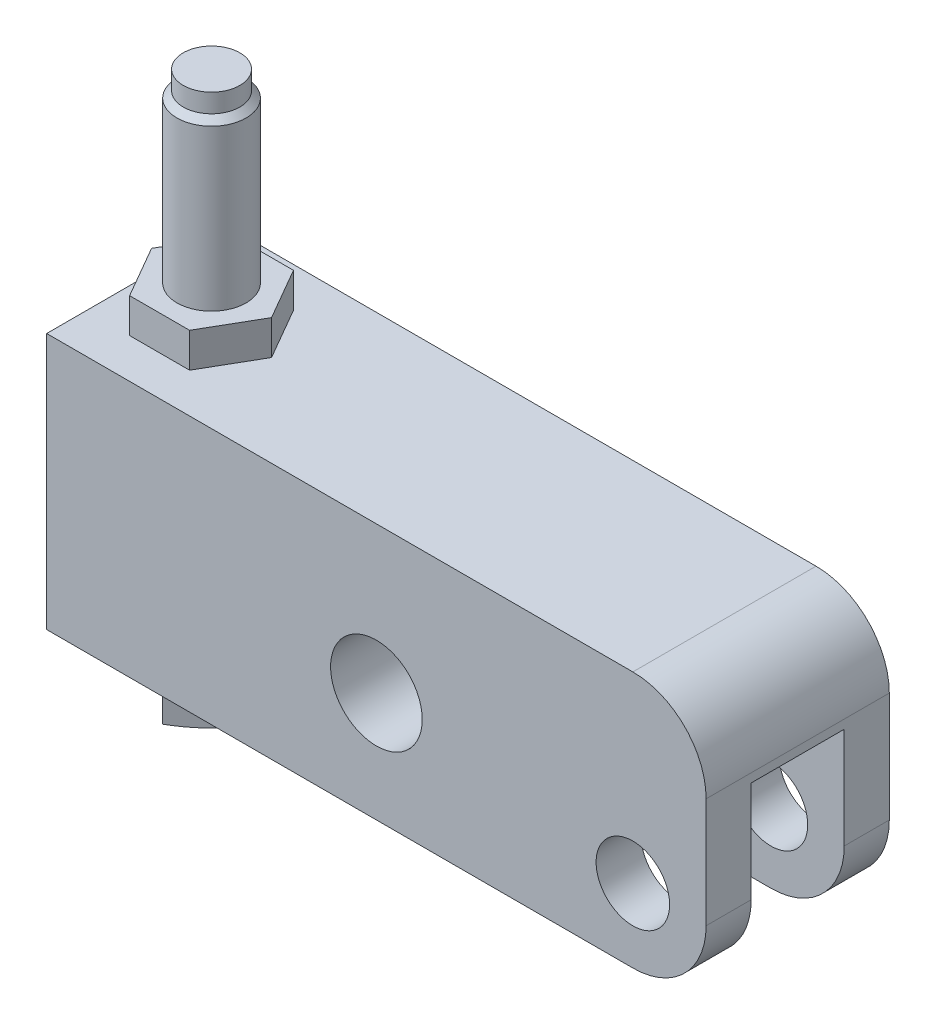
ISO-10303-21;
HEADER;
FILE_DESCRIPTION(('STEP AP214'),'2;1');
FILE_NAME('part.step','',(''),(''),'','','');
FILE_SCHEMA(('AUTOMOTIVE_DESIGN { 1 0 10303 214 1 1 1 1 }'));
ENDSEC;
DATA;
#1=APPLICATION_CONTEXT('core data for automotive mechanical design processes');
#2=APPLICATION_PROTOCOL_DEFINITION('international standard','automotive_design',2000,#1);
#3=PRODUCT_CONTEXT('',#1,'mechanical');
#4=PRODUCT('Part','Part','',(#3));
#5=PRODUCT_RELATED_PRODUCT_CATEGORY('part','',(#4));
#6=PRODUCT_DEFINITION_FORMATION('','',#4);
#7=PRODUCT_DEFINITION_CONTEXT('part definition',#1,'design');
#8=PRODUCT_DEFINITION('design','',#6,#7);
#9=PRODUCT_DEFINITION_SHAPE('','',#8);
#10=(LENGTH_UNIT() NAMED_UNIT(*) SI_UNIT(.MILLI.,.METRE.));
#11=(NAMED_UNIT(*) PLANE_ANGLE_UNIT() SI_UNIT($,.RADIAN.));
#12=(NAMED_UNIT(*) SI_UNIT($,.STERADIAN.) SOLID_ANGLE_UNIT());
#13=UNCERTAINTY_MEASURE_WITH_UNIT(LENGTH_MEASURE(1.E-05),#10,'distance_accuracy_value','');
#14=(GEOMETRIC_REPRESENTATION_CONTEXT(3) GLOBAL_UNCERTAINTY_ASSIGNED_CONTEXT((#13)) GLOBAL_UNIT_ASSIGNED_CONTEXT((#10,
#11,#12)) REPRESENTATION_CONTEXT('',''));
#15=CARTESIAN_POINT('',(0.,0.,0.));
#16=DIRECTION('',(0.,0.,1.));
#17=DIRECTION('',(1.,0.,0.));
#18=AXIS2_PLACEMENT_3D('',#15,#16,#17);
#19=CARTESIAN_POINT('',(-94.8944,-13.4112,0.));
#20=DIRECTION('',(0.,1.,0.));
#21=DIRECTION('',(0.,0.,1.));
#22=AXIS2_PLACEMENT_3D('',#19,#20,#21);
#23=PLANE('',#22);
#24=DIRECTION('',(0.707106781186547,0.,0.707106781186548));
#25=VECTOR('',#24,1.);
#26=CARTESIAN_POINT('',(-97.3773617782893,-13.4112,0.));
#27=LINE('',#26,#25);
#28=CARTESIAN_POINT('',(-93.1386808891447,-13.4112,4.23868088914464));
#29=VERTEX_POINT('',#28);
#30=CARTESIAN_POINT('',(-88.9,-13.4112,8.47736177828929));
#31=VERTEX_POINT('',#30);
#32=EDGE_CURVE('E191',#29,#31,#27,.T.);
#33=ORIENTED_EDGE('',*,*,#32,.T.);
#34=DIRECTION('',(0.707106781186547,0.,-0.707106781186548));
#35=VECTOR('',#34,1.);
#36=CARTESIAN_POINT('',(-88.9,-13.4112,8.47736177828929));
#37=LINE('',#36,#35);
#38=CARTESIAN_POINT('',(-84.6613191108553,-13.4112,4.23868088914464));
#39=VERTEX_POINT('',#38);
#40=EDGE_CURVE('E200',#31,#39,#37,.T.);
#41=ORIENTED_EDGE('',*,*,#40,.T.);
#42=CARTESIAN_POINT('',(-88.9,-13.4112,0.));
#43=DIRECTION('',(0.,1.,0.));
#44=DIRECTION('',(0.,0.,1.));
#45=AXIS2_PLACEMENT_3D('',#42,#43,#44);
#46=CIRCLE('',#45,5.99439999999997);
#47=EDGE_CURVE('E208',#29,#39,#46,.T.);
#48=ORIENTED_EDGE('',*,*,#47,.F.);
#49=EDGE_LOOP('',(#33,#41,#48));
#50=FACE_BOUND('',#49,.T.);
#51=ADVANCED_FACE('F33',(#50),#23,.T.);
#52=CARTESIAN_POINT('',(-84.6613191108553,-13.4112,-4.23868088914464));
#53=VERTEX_POINT('',#52);
#54=EDGE_CURVE('E226',#39,#53,#46,.T.);
#55=ORIENTED_EDGE('',*,*,#54,.F.);
#56=CARTESIAN_POINT('',(-80.4226382217107,-13.4112,0.));
#57=VERTEX_POINT('',#56);
#58=EDGE_CURVE('E203',#39,#57,#37,.T.);
#59=ORIENTED_EDGE('',*,*,#58,.T.);
#60=DIRECTION('',(-0.707106781186548,0.,-0.707106781186548));
#61=VECTOR('',#60,1.);
#62=CARTESIAN_POINT('',(-80.4226382217107,-13.4112,0.));
#63=LINE('',#62,#61);
#64=EDGE_CURVE('E400',#57,#53,#63,.T.);
#65=ORIENTED_EDGE('',*,*,#64,.T.);
#66=EDGE_LOOP('',(#55,#59,#65));
#67=FACE_BOUND('',#66,.T.);
#68=ADVANCED_FACE('F406',(#67),#23,.T.);
#69=CARTESIAN_POINT('',(-93.1386808891446,-13.4112,-4.23868088914464));
#70=VERTEX_POINT('',#69);
#71=EDGE_CURVE('E230',#53,#70,#46,.T.);
#72=ORIENTED_EDGE('',*,*,#71,.F.);
#73=CARTESIAN_POINT('',(-88.9,-13.4112,-8.47736177828928));
#74=VERTEX_POINT('',#73);
#75=EDGE_CURVE('E402',#53,#74,#63,.T.);
#76=ORIENTED_EDGE('',*,*,#75,.T.);
#77=DIRECTION('',(-0.707106781186548,0.,0.707106781186548));
#78=VECTOR('',#77,1.);
#79=CARTESIAN_POINT('',(-88.9,-13.4112,-8.47736177828928));
#80=LINE('',#79,#78);
#81=EDGE_CURVE('E210',#74,#70,#80,.T.);
#82=ORIENTED_EDGE('',*,*,#81,.T.);
#83=EDGE_LOOP('',(#72,#76,#82));
#84=FACE_BOUND('',#83,.T.);
#85=ADVANCED_FACE('F418',(#84),#23,.T.);
#86=CARTESIAN_POINT('',(-97.3773617782893,-13.4112,0.));
#87=VERTEX_POINT('',#86);
#88=EDGE_CURVE('E213',#70,#87,#80,.T.);
#89=ORIENTED_EDGE('',*,*,#88,.T.);
#90=EDGE_CURVE('E48',#87,#29,#27,.T.);
#91=ORIENTED_EDGE('',*,*,#90,.T.);
#92=EDGE_CURVE('E412',#70,#29,#46,.T.);
#93=ORIENTED_EDGE('',*,*,#92,.F.);
#94=EDGE_LOOP('',(#89,#91,#93));
#95=FACE_BOUND('',#94,.T.);
#96=ADVANCED_FACE('F415',(#95),#23,.T.);
#97=CARTESIAN_POINT('',(-101.6,31.75,15.875));
#98=DIRECTION('',(0.,-1.,0.));
#99=DIRECTION('',(0.,0.,-1.));
#100=AXIS2_PLACEMENT_3D('',#97,#98,#99);
#101=PLANE('',#100);
#102=DIRECTION('',(-1.,0.,0.));
#103=VECTOR('',#102,1.);
#104=CARTESIAN_POINT('',(-101.6,31.75,15.875));
#105=LINE('',#104,#103);
#106=CARTESIAN_POINT('',(0.,31.75,15.875));
#107=VERTEX_POINT('',#106);
#108=CARTESIAN_POINT('',(-101.6,31.75,15.875));
#109=VERTEX_POINT('',#108);
#110=EDGE_CURVE('E339',#107,#109,#105,.T.);
#111=ORIENTED_EDGE('',*,*,#110,.F.);
#112=DIRECTION('',(0.,0.,-1.));
#113=VECTOR('',#112,1.);
#114=CARTESIAN_POINT('',(0.,31.75,15.875));
#115=LINE('',#114,#113);
#116=CARTESIAN_POINT('',(0.,31.75,-15.875));
#117=VERTEX_POINT('',#116);
#118=EDGE_CURVE('E356',#107,#117,#115,.T.);
#119=ORIENTED_EDGE('',*,*,#118,.T.);
#120=DIRECTION('',(-1.,0.,0.));
#121=VECTOR('',#120,1.);
#122=CARTESIAN_POINT('',(-101.6,31.75,-15.875));
#123=LINE('',#122,#121);
#124=CARTESIAN_POINT('',(-101.6,31.75,-15.875));
#125=VERTEX_POINT('',#124);
#126=EDGE_CURVE('E333',#117,#125,#123,.T.);
#127=ORIENTED_EDGE('',*,*,#126,.T.);
#128=DIRECTION('',(0.,0.,-1.));
#129=VECTOR('',#128,1.);
#130=CARTESIAN_POINT('',(-101.6,31.75,15.875));
#131=LINE('',#130,#129);
#132=EDGE_CURVE('E341',#109,#125,#131,.T.);
#133=ORIENTED_EDGE('',*,*,#132,.F.);
#134=EDGE_LOOP('',(#111,#119,#127,#133));
#135=FACE_BOUND('',#134,.T.);
#136=DIRECTION('',(0.5,0.,-0.866025403784438));
#137=VECTOR('',#136,1.);
#138=CARTESIAN_POINT('',(-83.7013649711359,31.75,9.00430000000001));
#139=LINE('',#138,#137);
#140=CARTESIAN_POINT('',(-83.7013649711359,31.75,9.00430000000001));
#141=VERTEX_POINT('',#140);
#142=CARTESIAN_POINT('',(-78.5027299422717,31.75,0.));
#143=VERTEX_POINT('',#142);
#144=EDGE_CURVE('E236',#141,#143,#139,.T.);
#145=ORIENTED_EDGE('',*,*,#144,.F.);
#146=DIRECTION('',(1.,0.,0.));
#147=VECTOR('',#146,1.);
#148=CARTESIAN_POINT('',(-94.0986350288642,31.75,9.0043));
#149=LINE('',#148,#147);
#150=CARTESIAN_POINT('',(-94.0986350288642,31.75,9.0043));
#151=VERTEX_POINT('',#150);
#152=EDGE_CURVE('E241',#151,#141,#149,.T.);
#153=ORIENTED_EDGE('',*,*,#152,.F.);
#154=DIRECTION('',(0.5,0.,0.866025403784439));
#155=VECTOR('',#154,1.);
#156=CARTESIAN_POINT('',(-99.2972700577283,31.75,0.));
#157=LINE('',#156,#155);
#158=CARTESIAN_POINT('',(-99.2972700577283,31.75,0.));
#159=VERTEX_POINT('',#158);
#160=EDGE_CURVE('E263',#159,#151,#157,.T.);
#161=ORIENTED_EDGE('',*,*,#160,.F.);
#162=DIRECTION('',(-0.5,0.,0.866025403784439));
#163=VECTOR('',#162,1.);
#164=CARTESIAN_POINT('',(-94.0986350288642,31.75,-9.00430000000003));
#165=LINE('',#164,#163);
#166=CARTESIAN_POINT('',(-94.0986350288642,31.75,-9.00430000000003));
#167=VERTEX_POINT('',#166);
#168=EDGE_CURVE('E260',#167,#159,#165,.T.);
#169=ORIENTED_EDGE('',*,*,#168,.F.);
#170=DIRECTION('',(-1.,0.,0.));
#171=VECTOR('',#170,1.);
#172=CARTESIAN_POINT('',(-83.7013649711359,31.75,-9.00430000000003));
#173=LINE('',#172,#171);
#174=CARTESIAN_POINT('',(-83.7013649711359,31.75,-9.00430000000003));
#175=VERTEX_POINT('',#174);
#176=EDGE_CURVE('E257',#175,#167,#173,.T.);
#177=ORIENTED_EDGE('',*,*,#176,.F.);
#178=DIRECTION('',(-0.5,0.,-0.866025403784439));
#179=VECTOR('',#178,1.);
#180=CARTESIAN_POINT('',(-78.5027299422717,31.75,0.));
#181=LINE('',#180,#179);
#182=EDGE_CURVE('E254',#143,#175,#181,.T.);
#183=ORIENTED_EDGE('',*,*,#182,.F.);
#184=EDGE_LOOP('',(#145,#153,#161,#169,#177,#183));
#185=FACE_BOUND('',#184,.T.);
#186=ADVANCED_FACE('F425',(#135,#185),#101,.F.);
#187=CARTESIAN_POINT('',(0.,0.,15.875));
#188=DIRECTION('',(0.,0.,-1.));
#189=DIRECTION('',(-1.,0.,0.));
#190=AXIS2_PLACEMENT_3D('',#187,#188,#189);
#191=CYLINDRICAL_SURFACE('',#190,6.36905);
#192=CARTESIAN_POINT('',(0.,0.,8.0645));
#193=DIRECTION('',(0.,0.,1.));
#194=DIRECTION('',(1.,0.,0.));
#195=AXIS2_PLACEMENT_3D('',#192,#193,#194);
#196=CIRCLE('',#195,6.36905);
#197=CARTESIAN_POINT('',(6.36905,0.,8.0645));
#198=VERTEX_POINT('',#197);
#199=EDGE_CURVE('E322',#198,#198,#196,.T.);
#200=ORIENTED_EDGE('',*,*,#199,.F.);
#201=EDGE_LOOP('',(#200));
#202=FACE_BOUND('',#201,.T.);
#203=CARTESIAN_POINT('',(0.,0.,15.875));
#204=DIRECTION('',(0.,0.,1.));
#205=DIRECTION('',(1.,0.,0.));
#206=AXIS2_PLACEMENT_3D('',#203,#204,#205);
#207=CIRCLE('',#206,6.36905);
#208=CARTESIAN_POINT('',(6.36905,0.,15.875));
#209=VERTEX_POINT('',#208);
#210=EDGE_CURVE('E323',#209,#209,#207,.T.);
#211=ORIENTED_EDGE('',*,*,#210,.T.);
#212=EDGE_LOOP('',(#211));
#213=FACE_BOUND('',#212,.T.);
#214=ADVANCED_FACE('F576',(#202,#213),#191,.F.);
#215=CARTESIAN_POINT('',(-101.6,-12.7,15.875));
#216=DIRECTION('',(0.,0.,1.));
#217=DIRECTION('',(1.,0.,0.));
#218=AXIS2_PLACEMENT_3D('',#215,#216,#217);
#219=PLANE('',#218);
#220=ORIENTED_EDGE('',*,*,#210,.F.);
#221=EDGE_LOOP('',(#220));
#222=FACE_BOUND('',#221,.T.);
#223=DIRECTION('',(0.,1.,0.));
#224=VECTOR('',#223,1.);
#225=CARTESIAN_POINT('',(12.7,31.75,15.875));
#226=LINE('',#225,#224);
#227=CARTESIAN_POINT('',(12.7,0.,15.875));
#228=VERTEX_POINT('',#227);
#229=CARTESIAN_POINT('',(12.7,19.05,15.875));
#230=VERTEX_POINT('',#229);
#231=EDGE_CURVE('E336',#228,#230,#226,.T.);
#232=ORIENTED_EDGE('',*,*,#231,.T.);
#233=CARTESIAN_POINT('',(0.,19.05,15.875));
#234=DIRECTION('',(0.,0.,1.));
#235=DIRECTION('',(1.,0.,0.));
#236=AXIS2_PLACEMENT_3D('',#233,#234,#235);
#237=CIRCLE('',#236,12.7);
#238=EDGE_CURVE('E377',#230,#107,#237,.T.);
#239=ORIENTED_EDGE('',*,*,#238,.T.);
#240=ORIENTED_EDGE('',*,*,#110,.T.);
#241=DIRECTION('',(0.,-1.,0.));
#242=VECTOR('',#241,1.);
#243=CARTESIAN_POINT('',(-101.6,31.75,15.875));
#244=LINE('',#243,#242);
#245=CARTESIAN_POINT('',(-101.6,-12.7,15.875));
#246=VERTEX_POINT('',#245);
#247=EDGE_CURVE('E329',#109,#246,#244,.T.);
#248=ORIENTED_EDGE('',*,*,#247,.T.);
#249=DIRECTION('',(1.,0.,0.));
#250=VECTOR('',#249,1.);
#251=CARTESIAN_POINT('',(-101.6,-12.7,15.875));
#252=LINE('',#251,#250);
#253=CARTESIAN_POINT('',(0.,-12.7,15.875));
#254=VERTEX_POINT('',#253);
#255=EDGE_CURVE('E332',#246,#254,#252,.T.);
#256=ORIENTED_EDGE('',*,*,#255,.T.);
#257=CARTESIAN_POINT('',(0.,0.,15.875));
#258=DIRECTION('',(0.,0.,1.));
#259=DIRECTION('',(1.,0.,0.));
#260=AXIS2_PLACEMENT_3D('',#257,#258,#259);
#261=CIRCLE('',#260,12.7);
#262=EDGE_CURVE('E375',#254,#228,#261,.T.);
#263=ORIENTED_EDGE('',*,*,#262,.T.);
#264=EDGE_LOOP('',(#232,#239,#240,#248,#256,#263));
#265=FACE_BOUND('',#264,.T.);
#266=CARTESIAN_POINT('',(-44.45,6.35,15.875));
#267=DIRECTION('',(0.,0.,1.));
#268=DIRECTION('',(1.,0.,0.));
#269=AXIS2_PLACEMENT_3D('',#266,#267,#268);
#270=CIRCLE('',#269,7.94384999999999);
#271=CARTESIAN_POINT('',(-36.50615,6.35,15.875));
#272=VERTEX_POINT('',#271);
#273=EDGE_CURVE('E315',#272,#272,#270,.T.);
#274=ORIENTED_EDGE('',*,*,#273,.F.);
#275=EDGE_LOOP('',(#274));
#276=FACE_BOUND('',#275,.T.);
#277=ADVANCED_FACE('F577',(#222,#265,#276),#219,.T.);
#278=CARTESIAN_POINT('',(-101.6,-12.7,-15.875));
#279=DIRECTION('',(0.,0.,1.));
#280=DIRECTION('',(1.,0.,0.));
#281=AXIS2_PLACEMENT_3D('',#278,#279,#280);
#282=PLANE('',#281);
#283=CARTESIAN_POINT('',(0.,0.,-15.875));
#284=DIRECTION('',(0.,0.,1.));
#285=DIRECTION('',(1.,0.,0.));
#286=AXIS2_PLACEMENT_3D('',#283,#284,#285);
#287=CIRCLE('',#286,6.36905);
#288=CARTESIAN_POINT('',(6.36905,0.,-15.875));
#289=VERTEX_POINT('',#288);
#290=EDGE_CURVE('E318',#289,#289,#287,.T.);
#291=ORIENTED_EDGE('',*,*,#290,.T.);
#292=EDGE_LOOP('',(#291));
#293=FACE_BOUND('',#292,.T.);
#294=ORIENTED_EDGE('',*,*,#126,.F.);
#295=CARTESIAN_POINT('',(0.,19.05,-15.875));
#296=DIRECTION('',(0.,0.,1.));
#297=DIRECTION('',(1.,0.,0.));
#298=AXIS2_PLACEMENT_3D('',#295,#296,#297);
#299=CIRCLE('',#298,12.7);
#300=CARTESIAN_POINT('',(12.7,19.05,-15.875));
#301=VERTEX_POINT('',#300);
#302=EDGE_CURVE('E365',#117,#301,#299,.F.);
#303=ORIENTED_EDGE('',*,*,#302,.T.);
#304=DIRECTION('',(0.,1.,0.));
#305=VECTOR('',#304,1.);
#306=CARTESIAN_POINT('',(12.7,31.75,-15.875));
#307=LINE('',#306,#305);
#308=CARTESIAN_POINT('',(12.7,0.,-15.875));
#309=VERTEX_POINT('',#308);
#310=EDGE_CURVE('E347',#309,#301,#307,.T.);
#311=ORIENTED_EDGE('',*,*,#310,.F.);
#312=CARTESIAN_POINT('',(0.,0.,-15.875));
#313=DIRECTION('',(0.,0.,1.));
#314=DIRECTION('',(1.,0.,0.));
#315=AXIS2_PLACEMENT_3D('',#312,#313,#314);
#316=CIRCLE('',#315,12.7);
#317=CARTESIAN_POINT('',(0.,-12.7,-15.875));
#318=VERTEX_POINT('',#317);
#319=EDGE_CURVE('E363',#309,#318,#316,.F.);
#320=ORIENTED_EDGE('',*,*,#319,.T.);
#321=DIRECTION('',(1.,0.,0.));
#322=VECTOR('',#321,1.);
#323=CARTESIAN_POINT('',(-101.6,-12.7,-15.875));
#324=LINE('',#323,#322);
#325=CARTESIAN_POINT('',(-101.6,-12.7,-15.875));
#326=VERTEX_POINT('',#325);
#327=EDGE_CURVE('E344',#326,#318,#324,.T.);
#328=ORIENTED_EDGE('',*,*,#327,.F.);
#329=DIRECTION('',(0.,-1.,0.));
#330=VECTOR('',#329,1.);
#331=CARTESIAN_POINT('',(-101.6,31.75,-15.875));
#332=LINE('',#331,#330);
#333=EDGE_CURVE('E326',#125,#326,#332,.T.);
#334=ORIENTED_EDGE('',*,*,#333,.F.);
#335=EDGE_LOOP('',(#294,#303,#311,#320,#328,#334));
#336=FACE_BOUND('',#335,.T.);
#337=CARTESIAN_POINT('',(-44.45,6.35,-15.875));
#338=DIRECTION('',(0.,0.,1.));
#339=DIRECTION('',(1.,0.,0.));
#340=AXIS2_PLACEMENT_3D('',#337,#338,#339);
#341=CIRCLE('',#340,7.94384999999999);
#342=CARTESIAN_POINT('',(-36.50615,6.35,-15.875));
#343=VERTEX_POINT('',#342);
#344=EDGE_CURVE('E319',#343,#343,#341,.T.);
#345=ORIENTED_EDGE('',*,*,#344,.T.);
#346=EDGE_LOOP('',(#345));
#347=FACE_BOUND('',#346,.T.);
#348=ADVANCED_FACE('F580',(#293,#336,#347),#282,.F.);
#349=CARTESIAN_POINT('',(-101.6,31.75,15.875));
#350=DIRECTION('',(1.,0.,0.));
#351=DIRECTION('',(0.,0.,-1.));
#352=AXIS2_PLACEMENT_3D('',#349,#350,#351);
#353=PLANE('',#352);
#354=ORIENTED_EDGE('',*,*,#333,.T.);
#355=DIRECTION('',(0.,0.,-1.));
#356=VECTOR('',#355,1.);
#357=CARTESIAN_POINT('',(-101.6,-12.7,15.875));
#358=LINE('',#357,#356);
#359=EDGE_CURVE('E353',#246,#326,#358,.T.);
#360=ORIENTED_EDGE('',*,*,#359,.F.);
#361=ORIENTED_EDGE('',*,*,#247,.F.);
#362=ORIENTED_EDGE('',*,*,#132,.T.);
#363=EDGE_LOOP('',(#354,#360,#361,#362));
#364=FACE_BOUND('',#363,.T.);
#365=ADVANCED_FACE('F584',(#364),#353,.F.);
#366=CARTESIAN_POINT('',(-101.6,-12.7,15.875));
#367=DIRECTION('',(0.,1.,0.));
#368=DIRECTION('',(0.,0.,1.));
#369=AXIS2_PLACEMENT_3D('',#366,#367,#368);
#370=PLANE('',#369);
#371=CARTESIAN_POINT('',(-88.9,-12.7,0.));
#372=DIRECTION('',(0.,1.,0.));
#373=DIRECTION('',(0.,0.,1.));
#374=AXIS2_PLACEMENT_3D('',#371,#372,#373);
#375=CIRCLE('',#374,5.99439999999998);
#376=CARTESIAN_POINT('',(-88.9,-12.7,5.99439999999998));
#377=VERTEX_POINT('',#376);
#378=EDGE_CURVE('E233',#377,#377,#375,.T.);
#379=ORIENTED_EDGE('',*,*,#378,.T.);
#380=EDGE_LOOP('',(#379));
#381=FACE_BOUND('',#380,.T.);
#382=ORIENTED_EDGE('',*,*,#327,.T.);
#383=DIRECTION('',(0.,0.,-1.));
#384=VECTOR('',#383,1.);
#385=CARTESIAN_POINT('',(0.,-12.7,15.875));
#386=LINE('',#385,#384);
#387=CARTESIAN_POINT('',(0.,-12.7,-8.0645));
#388=VERTEX_POINT('',#387);
#389=EDGE_CURVE('E381',#318,#388,#386,.F.);
#390=ORIENTED_EDGE('',*,*,#389,.T.);
#391=DIRECTION('',(1.,0.,0.));
#392=VECTOR('',#391,1.);
#393=CARTESIAN_POINT('',(-17.526,-12.7,-8.0645));
#394=LINE('',#393,#392);
#395=CARTESIAN_POINT('',(-17.526,-12.7,-8.0645));
#396=VERTEX_POINT('',#395);
#397=EDGE_CURVE('E300',#396,#388,#394,.T.);
#398=ORIENTED_EDGE('',*,*,#397,.F.);
#399=CARTESIAN_POINT('',(-17.526,-12.7,0.));
#400=DIRECTION('',(0.,-1.,0.));
#401=DIRECTION('',(0.,0.,-1.));
#402=AXIS2_PLACEMENT_3D('',#399,#400,#401);
#403=CIRCLE('',#402,8.0645);
#404=CARTESIAN_POINT('',(-17.526,-12.7,8.0645));
#405=VERTEX_POINT('',#404);
#406=EDGE_CURVE('E285',#405,#396,#403,.T.);
#407=ORIENTED_EDGE('',*,*,#406,.F.);
#408=DIRECTION('',(-1.,0.,0.));
#409=VECTOR('',#408,1.);
#410=CARTESIAN_POINT('',(-17.526,-12.7,8.0645));
#411=LINE('',#410,#409);
#412=CARTESIAN_POINT('',(0.,-12.7,8.0645));
#413=VERTEX_POINT('',#412);
#414=EDGE_CURVE('E290',#413,#405,#411,.T.);
#415=ORIENTED_EDGE('',*,*,#414,.F.);
#416=DIRECTION('',(0.,0.,-1.));
#417=VECTOR('',#416,1.);
#418=CARTESIAN_POINT('',(0.,-12.7,15.875));
#419=LINE('',#418,#417);
#420=EDGE_CURVE('E379',#413,#254,#419,.F.);
#421=ORIENTED_EDGE('',*,*,#420,.T.);
#422=ORIENTED_EDGE('',*,*,#255,.F.);
#423=ORIENTED_EDGE('',*,*,#359,.T.);
#424=EDGE_LOOP('',(#382,#390,#398,#407,#415,#421,#422,#423));
#425=FACE_BOUND('',#424,.T.);
#426=ADVANCED_FACE('F590',(#381,#425),#370,.F.);
#427=CARTESIAN_POINT('',(12.7,31.75,15.875));
#428=DIRECTION('',(-1.,0.,0.));
#429=DIRECTION('',(0.,-1.,0.));
#430=AXIS2_PLACEMENT_3D('',#427,#428,#429);
#431=PLANE('',#430);
#432=ORIENTED_EDGE('',*,*,#310,.T.);
#433=DIRECTION('',(0.,0.,-1.));
#434=VECTOR('',#433,1.);
#435=CARTESIAN_POINT('',(12.7,19.05,15.875));
#436=LINE('',#435,#434);
#437=EDGE_CURVE('E373',#301,#230,#436,.F.);
#438=ORIENTED_EDGE('',*,*,#437,.T.);
#439=ORIENTED_EDGE('',*,*,#231,.F.);
#440=DIRECTION('',(0.,0.,-1.));
#441=VECTOR('',#440,1.);
#442=CARTESIAN_POINT('',(12.7,0.,15.875));
#443=LINE('',#442,#441);
#444=CARTESIAN_POINT('',(12.7,0.,8.0645));
#445=VERTEX_POINT('',#444);
#446=EDGE_CURVE('E367',#228,#445,#443,.T.);
#447=ORIENTED_EDGE('',*,*,#446,.T.);
#448=DIRECTION('',(0.,-1.,0.));
#449=VECTOR('',#448,1.);
#450=CARTESIAN_POINT('',(12.7,17.526,8.0645));
#451=LINE('',#450,#449);
#452=CARTESIAN_POINT('',(12.7,17.526,8.0645));
#453=VERTEX_POINT('',#452);
#454=EDGE_CURVE('E308',#453,#445,#451,.T.);
#455=ORIENTED_EDGE('',*,*,#454,.F.);
#456=DIRECTION('',(0.,0.,1.));
#457=VECTOR('',#456,1.);
#458=CARTESIAN_POINT('',(12.7,17.526,8.0645));
#459=LINE('',#458,#457);
#460=CARTESIAN_POINT('',(12.7,17.526,-8.0645));
#461=VERTEX_POINT('',#460);
#462=EDGE_CURVE('E292',#461,#453,#459,.T.);
#463=ORIENTED_EDGE('',*,*,#462,.F.);
#464=DIRECTION('',(0.,-1.,0.));
#465=VECTOR('',#464,1.);
#466=CARTESIAN_POINT('',(12.7,17.526,-8.0645));
#467=LINE('',#466,#465);
#468=CARTESIAN_POINT('',(12.7,0.,-8.0645));
#469=VERTEX_POINT('',#468);
#470=EDGE_CURVE('E311',#461,#469,#467,.T.);
#471=ORIENTED_EDGE('',*,*,#470,.T.);
#472=DIRECTION('',(0.,0.,-1.));
#473=VECTOR('',#472,1.);
#474=CARTESIAN_POINT('',(12.7,0.,15.875));
#475=LINE('',#474,#473);
#476=EDGE_CURVE('E370',#469,#309,#475,.T.);
#477=ORIENTED_EDGE('',*,*,#476,.T.);
#478=EDGE_LOOP('',(#432,#438,#439,#447,#455,#463,#471,#477));
#479=FACE_BOUND('',#478,.T.);
#480=ADVANCED_FACE('F574',(#479),#431,.F.);
#481=CARTESIAN_POINT('',(0.,0.,-8.0645));
#482=DIRECTION('',(0.,0.,-1.));
#483=DIRECTION('',(-1.,0.,0.));
#484=AXIS2_PLACEMENT_3D('',#481,#482,#483);
#485=CIRCLE('',#484,6.36905);
#486=CARTESIAN_POINT('',(-6.36905,0.,-8.0645));
#487=VERTEX_POINT('',#486);
#488=EDGE_CURVE('E307',#487,#487,#485,.T.);
#489=ORIENTED_EDGE('',*,*,#488,.F.);
#490=EDGE_LOOP('',(#489));
#491=FACE_BOUND('',#490,.T.);
#492=ORIENTED_EDGE('',*,*,#290,.F.);
#493=EDGE_LOOP('',(#492));
#494=FACE_BOUND('',#493,.T.);
#495=ADVANCED_FACE('F570',(#491,#494),#191,.F.);
#496=CARTESIAN_POINT('',(-44.45,6.35,15.875));
#497=DIRECTION('',(0.,0.,-1.));
#498=DIRECTION('',(-1.,0.,0.));
#499=AXIS2_PLACEMENT_3D('',#496,#497,#498);
#500=CYLINDRICAL_SURFACE('',#499,7.94384999999999);
#501=ORIENTED_EDGE('',*,*,#273,.T.);
#502=EDGE_LOOP('',(#501));
#503=FACE_BOUND('',#502,.T.);
#504=ORIENTED_EDGE('',*,*,#344,.F.);
#505=EDGE_LOOP('',(#504));
#506=FACE_BOUND('',#505,.T.);
#507=ADVANCED_FACE('F566',(#503,#506),#500,.F.);
#508=CARTESIAN_POINT('',(-17.526,17.526,0.));
#509=DIRECTION('',(0.,-1.,0.));
#510=DIRECTION('',(0.,0.,-1.));
#511=AXIS2_PLACEMENT_3D('',#508,#509,#510);
#512=CYLINDRICAL_SURFACE('',#511,8.0645);
#513=ORIENTED_EDGE('',*,*,#406,.T.);
#514=DIRECTION('',(0.,-1.,0.));
#515=VECTOR('',#514,1.);
#516=CARTESIAN_POINT('',(-17.526,17.526,-8.0645));
#517=LINE('',#516,#515);
#518=CARTESIAN_POINT('',(-17.526,17.526,-8.0645));
#519=VERTEX_POINT('',#518);
#520=EDGE_CURVE('E297',#519,#396,#517,.T.);
#521=ORIENTED_EDGE('',*,*,#520,.F.);
#522=CARTESIAN_POINT('',(-17.526,17.526,0.));
#523=DIRECTION('',(0.,-1.,0.));
#524=DIRECTION('',(0.,0.,-1.));
#525=AXIS2_PLACEMENT_3D('',#522,#523,#524);
#526=CIRCLE('',#525,8.0645);
#527=CARTESIAN_POINT('',(-17.526,17.526,8.0645));
#528=VERTEX_POINT('',#527);
#529=EDGE_CURVE('E286',#528,#519,#526,.T.);
#530=ORIENTED_EDGE('',*,*,#529,.F.);
#531=DIRECTION('',(0.,-1.,0.));
#532=VECTOR('',#531,1.);
#533=CARTESIAN_POINT('',(-17.526,17.526,8.0645));
#534=LINE('',#533,#532);
#535=EDGE_CURVE('E304',#528,#405,#534,.T.);
#536=ORIENTED_EDGE('',*,*,#535,.T.);
#537=EDGE_LOOP('',(#513,#521,#530,#536));
#538=FACE_BOUND('',#537,.T.);
#539=ADVANCED_FACE('F559',(#538),#512,.F.);
#540=CARTESIAN_POINT('',(-17.526,17.526,8.0645));
#541=DIRECTION('',(0.,0.,1.));
#542=DIRECTION('',(1.,0.,0.));
#543=AXIS2_PLACEMENT_3D('',#540,#541,#542);
#544=PLANE('',#543);
#545=ORIENTED_EDGE('',*,*,#199,.T.);
#546=EDGE_LOOP('',(#545));
#547=FACE_BOUND('',#546,.T.);
#548=ORIENTED_EDGE('',*,*,#454,.T.);
#549=CARTESIAN_POINT('',(0.,0.,8.0645));
#550=DIRECTION('',(0.,0.,1.));
#551=DIRECTION('',(1.,0.,0.));
#552=AXIS2_PLACEMENT_3D('',#549,#550,#551);
#553=CIRCLE('',#552,12.7);
#554=EDGE_CURVE('E385',#445,#413,#553,.F.);
#555=ORIENTED_EDGE('',*,*,#554,.T.);
#556=ORIENTED_EDGE('',*,*,#414,.T.);
#557=ORIENTED_EDGE('',*,*,#535,.F.);
#558=DIRECTION('',(-1.,0.,0.));
#559=VECTOR('',#558,1.);
#560=CARTESIAN_POINT('',(-17.526,17.526,8.0645));
#561=LINE('',#560,#559);
#562=EDGE_CURVE('E294',#453,#528,#561,.T.);
#563=ORIENTED_EDGE('',*,*,#562,.F.);
#564=EDGE_LOOP('',(#548,#555,#556,#557,#563));
#565=FACE_BOUND('',#564,.T.);
#566=ADVANCED_FACE('F556',(#547,#565),#544,.F.);
#567=CARTESIAN_POINT('',(-17.526,17.526,-8.0645));
#568=DIRECTION('',(0.,0.,-1.));
#569=DIRECTION('',(-1.,0.,0.));
#570=AXIS2_PLACEMENT_3D('',#567,#568,#569);
#571=PLANE('',#570);
#572=ORIENTED_EDGE('',*,*,#488,.T.);
#573=EDGE_LOOP('',(#572));
#574=FACE_BOUND('',#573,.T.);
#575=ORIENTED_EDGE('',*,*,#397,.T.);
#576=CARTESIAN_POINT('',(0.,0.,-8.0645));
#577=DIRECTION('',(0.,0.,-1.));
#578=DIRECTION('',(-1.,0.,0.));
#579=AXIS2_PLACEMENT_3D('',#576,#577,#578);
#580=CIRCLE('',#579,12.7);
#581=EDGE_CURVE('E383',#388,#469,#580,.F.);
#582=ORIENTED_EDGE('',*,*,#581,.T.);
#583=ORIENTED_EDGE('',*,*,#470,.F.);
#584=DIRECTION('',(1.,0.,0.));
#585=VECTOR('',#584,1.);
#586=CARTESIAN_POINT('',(-17.526,17.526,-8.0645));
#587=LINE('',#586,#585);
#588=EDGE_CURVE('E289',#519,#461,#587,.T.);
#589=ORIENTED_EDGE('',*,*,#588,.F.);
#590=ORIENTED_EDGE('',*,*,#520,.T.);
#591=EDGE_LOOP('',(#575,#582,#583,#589,#590));
#592=FACE_BOUND('',#591,.T.);
#593=ADVANCED_FACE('F554',(#574,#592),#571,.F.);
#594=CARTESIAN_POINT('',(-17.526,17.526,0.));
#595=DIRECTION('',(0.,-1.,0.));
#596=DIRECTION('',(0.,0.,-1.));
#597=AXIS2_PLACEMENT_3D('',#594,#595,#596);
#598=PLANE('',#597);
#599=ORIENTED_EDGE('',*,*,#529,.T.);
#600=ORIENTED_EDGE('',*,*,#588,.T.);
#601=ORIENTED_EDGE('',*,*,#462,.T.);
#602=ORIENTED_EDGE('',*,*,#562,.T.);
#603=EDGE_LOOP('',(#599,#600,#601,#602));
#604=FACE_BOUND('',#603,.T.);
#605=ADVANCED_FACE('F550',(#604),#598,.T.);
#606=CARTESIAN_POINT('',(0.,19.05,15.875));
#607=DIRECTION('',(0.,0.,-1.));
#608=DIRECTION('',(-1.,0.,0.));
#609=AXIS2_PLACEMENT_3D('',#606,#607,#608);
#610=CYLINDRICAL_SURFACE('',#609,12.7);
#611=ORIENTED_EDGE('',*,*,#238,.F.);
#612=ORIENTED_EDGE('',*,*,#437,.F.);
#613=ORIENTED_EDGE('',*,*,#302,.F.);
#614=ORIENTED_EDGE('',*,*,#118,.F.);
#615=EDGE_LOOP('',(#611,#612,#613,#614));
#616=FACE_BOUND('',#615,.T.);
#617=ADVANCED_FACE('F553',(#616),#610,.T.);
#618=CARTESIAN_POINT('',(0.,0.,15.875));
#619=DIRECTION('',(0.,0.,-1.));
#620=DIRECTION('',(-1.,0.,0.));
#621=AXIS2_PLACEMENT_3D('',#618,#619,#620);
#622=CYLINDRICAL_SURFACE('',#621,12.7);
#623=ORIENTED_EDGE('',*,*,#581,.F.);
#624=ORIENTED_EDGE('',*,*,#389,.F.);
#625=ORIENTED_EDGE('',*,*,#319,.F.);
#626=ORIENTED_EDGE('',*,*,#476,.F.);
#627=EDGE_LOOP('',(#623,#624,#625,#626));
#628=FACE_BOUND('',#627,.T.);
#629=ADVANCED_FACE('F599',(#628),#622,.T.);
#630=CARTESIAN_POINT('',(0.,0.,15.875));
#631=DIRECTION('',(0.,0.,-1.));
#632=DIRECTION('',(-1.,0.,0.));
#633=AXIS2_PLACEMENT_3D('',#630,#631,#632);
#634=CYLINDRICAL_SURFACE('',#633,12.7);
#635=ORIENTED_EDGE('',*,*,#262,.F.);
#636=ORIENTED_EDGE('',*,*,#420,.F.);
#637=ORIENTED_EDGE('',*,*,#554,.F.);
#638=ORIENTED_EDGE('',*,*,#446,.F.);
#639=EDGE_LOOP('',(#635,#636,#637,#638));
#640=FACE_BOUND('',#639,.T.);
#641=ADVANCED_FACE('F35',(#640),#634,.T.);
#642=CARTESIAN_POINT('',(-83.7013649711359,37.7444,9.00430000000001));
#643=DIRECTION('',(-0.866025403784438,0.,-0.5));
#644=DIRECTION('',(-0.5,0.,0.866025403784438));
#645=AXIS2_PLACEMENT_3D('',#642,#643,#644);
#646=PLANE('',#645);
#647=ORIENTED_EDGE('',*,*,#144,.T.);
#648=DIRECTION('',(0.,-1.,0.));
#649=VECTOR('',#648,1.);
#650=CARTESIAN_POINT('',(-78.5027299422717,37.7444,0.));
#651=LINE('',#650,#649);
#652=CARTESIAN_POINT('',(-78.5027299422717,37.7444,0.));
#653=VERTEX_POINT('',#652);
#654=EDGE_CURVE('E282',#653,#143,#651,.T.);
#655=ORIENTED_EDGE('',*,*,#654,.F.);
#656=DIRECTION('',(0.5,0.,-0.866025403784438));
#657=VECTOR('',#656,1.);
#658=CARTESIAN_POINT('',(-83.7013649711359,37.7444,9.00430000000001));
#659=LINE('',#658,#657);
#660=CARTESIAN_POINT('',(-83.7013649711359,37.7444,9.00430000000001));
#661=VERTEX_POINT('',#660);
#662=EDGE_CURVE('E237',#661,#653,#659,.T.);
#663=ORIENTED_EDGE('',*,*,#662,.F.);
#664=DIRECTION('',(0.,-1.,0.));
#665=VECTOR('',#664,1.);
#666=CARTESIAN_POINT('',(-83.7013649711359,37.7444,9.00430000000001));
#667=LINE('',#666,#665);
#668=EDGE_CURVE('E251',#661,#141,#667,.T.);
#669=ORIENTED_EDGE('',*,*,#668,.T.);
#670=EDGE_LOOP('',(#647,#655,#663,#669));
#671=FACE_BOUND('',#670,.T.);
#672=ADVANCED_FACE('F545',(#671),#646,.F.);
#673=CARTESIAN_POINT('',(-78.5027299422717,37.7444,0.));
#674=DIRECTION('',(-0.866025403784439,0.,0.5));
#675=DIRECTION('',(0.5,0.,0.866025403784439));
#676=AXIS2_PLACEMENT_3D('',#673,#674,#675);
#677=PLANE('',#676);
#678=ORIENTED_EDGE('',*,*,#182,.T.);
#679=DIRECTION('',(0.,-1.,0.));
#680=VECTOR('',#679,1.);
#681=CARTESIAN_POINT('',(-83.7013649711359,37.7444,-9.00430000000003));
#682=LINE('',#681,#680);
#683=CARTESIAN_POINT('',(-83.7013649711359,37.7444,-9.00430000000003));
#684=VERTEX_POINT('',#683);
#685=EDGE_CURVE('E279',#684,#175,#682,.T.);
#686=ORIENTED_EDGE('',*,*,#685,.F.);
#687=DIRECTION('',(-0.5,0.,-0.866025403784439));
#688=VECTOR('',#687,1.);
#689=CARTESIAN_POINT('',(-78.5027299422717,37.7444,0.));
#690=LINE('',#689,#688);
#691=EDGE_CURVE('E240',#653,#684,#690,.T.);
#692=ORIENTED_EDGE('',*,*,#691,.F.);
#693=ORIENTED_EDGE('',*,*,#654,.T.);
#694=EDGE_LOOP('',(#678,#686,#692,#693));
#695=FACE_BOUND('',#694,.T.);
#696=ADVANCED_FACE('F541',(#695),#677,.F.);
#697=CARTESIAN_POINT('',(-83.7013649711359,37.7444,-9.00430000000003));
#698=DIRECTION('',(0.,0.,1.));
#699=DIRECTION('',(1.,0.,0.));
#700=AXIS2_PLACEMENT_3D('',#697,#698,#699);
#701=PLANE('',#700);
#702=ORIENTED_EDGE('',*,*,#176,.T.);
#703=DIRECTION('',(0.,-1.,0.));
#704=VECTOR('',#703,1.);
#705=CARTESIAN_POINT('',(-94.0986350288642,37.7444,-9.00430000000003));
#706=LINE('',#705,#704);
#707=CARTESIAN_POINT('',(-94.0986350288642,37.7444,-9.00430000000003));
#708=VERTEX_POINT('',#707);
#709=EDGE_CURVE('E276',#708,#167,#706,.T.);
#710=ORIENTED_EDGE('',*,*,#709,.F.);
#711=DIRECTION('',(-1.,0.,0.));
#712=VECTOR('',#711,1.);
#713=CARTESIAN_POINT('',(-83.7013649711359,37.7444,-9.00430000000003));
#714=LINE('',#713,#712);
#715=EDGE_CURVE('E243',#684,#708,#714,.T.);
#716=ORIENTED_EDGE('',*,*,#715,.F.);
#717=ORIENTED_EDGE('',*,*,#685,.T.);
#718=EDGE_LOOP('',(#702,#710,#716,#717));
#719=FACE_BOUND('',#718,.T.);
#720=ADVANCED_FACE('F537',(#719),#701,.F.);
#721=CARTESIAN_POINT('',(-94.0986350288642,37.7444,-9.00430000000003));
#722=DIRECTION('',(0.866025403784439,0.,0.499999999999999));
#723=DIRECTION('',(0.5,0.,-0.866025403784439));
#724=AXIS2_PLACEMENT_3D('',#721,#722,#723);
#725=PLANE('',#724);
#726=ORIENTED_EDGE('',*,*,#168,.T.);
#727=DIRECTION('',(0.,-1.,0.));
#728=VECTOR('',#727,1.);
#729=CARTESIAN_POINT('',(-99.2972700577283,37.7444,0.));
#730=LINE('',#729,#728);
#731=CARTESIAN_POINT('',(-99.2972700577283,37.7444,0.));
#732=VERTEX_POINT('',#731);
#733=EDGE_CURVE('E273',#732,#159,#730,.T.);
#734=ORIENTED_EDGE('',*,*,#733,.F.);
#735=DIRECTION('',(-0.5,0.,0.866025403784439));
#736=VECTOR('',#735,1.);
#737=CARTESIAN_POINT('',(-94.0986350288642,37.7444,-9.00430000000003));
#738=LINE('',#737,#736);
#739=EDGE_CURVE('E245',#708,#732,#738,.T.);
#740=ORIENTED_EDGE('',*,*,#739,.F.);
#741=ORIENTED_EDGE('',*,*,#709,.T.);
#742=EDGE_LOOP('',(#726,#734,#740,#741));
#743=FACE_BOUND('',#742,.T.);
#744=ADVANCED_FACE('F533',(#743),#725,.F.);
#745=CARTESIAN_POINT('',(-99.2972700577283,37.7444,0.));
#746=DIRECTION('',(0.866025403784439,0.,-0.5));
#747=DIRECTION('',(-0.5,0.,-0.866025403784439));
#748=AXIS2_PLACEMENT_3D('',#745,#746,#747);
#749=PLANE('',#748);
#750=ORIENTED_EDGE('',*,*,#160,.T.);
#751=DIRECTION('',(0.,-1.,0.));
#752=VECTOR('',#751,1.);
#753=CARTESIAN_POINT('',(-94.0986350288642,37.7444,9.0043));
#754=LINE('',#753,#752);
#755=CARTESIAN_POINT('',(-94.0986350288642,37.7444,9.0043));
#756=VERTEX_POINT('',#755);
#757=EDGE_CURVE('E270',#756,#151,#754,.T.);
#758=ORIENTED_EDGE('',*,*,#757,.F.);
#759=DIRECTION('',(0.5,0.,0.866025403784439));
#760=VECTOR('',#759,1.);
#761=CARTESIAN_POINT('',(-99.2972700577283,37.7444,0.));
#762=LINE('',#761,#760);
#763=EDGE_CURVE('E247',#732,#756,#762,.T.);
#764=ORIENTED_EDGE('',*,*,#763,.F.);
#765=ORIENTED_EDGE('',*,*,#733,.T.);
#766=EDGE_LOOP('',(#750,#758,#764,#765));
#767=FACE_BOUND('',#766,.T.);
#768=ADVANCED_FACE('F529',(#767),#749,.F.);
#769=CARTESIAN_POINT('',(-94.0986350288642,37.7444,9.0043));
#770=DIRECTION('',(0.,0.,-1.));
#771=DIRECTION('',(-1.,0.,0.));
#772=AXIS2_PLACEMENT_3D('',#769,#770,#771);
#773=PLANE('',#772);
#774=ORIENTED_EDGE('',*,*,#152,.T.);
#775=ORIENTED_EDGE('',*,*,#668,.F.);
#776=DIRECTION('',(1.,0.,0.));
#777=VECTOR('',#776,1.);
#778=CARTESIAN_POINT('',(-94.0986350288642,37.7444,9.0043));
#779=LINE('',#778,#777);
#780=EDGE_CURVE('E249',#756,#661,#779,.T.);
#781=ORIENTED_EDGE('',*,*,#780,.F.);
#782=ORIENTED_EDGE('',*,*,#757,.T.);
#783=EDGE_LOOP('',(#774,#775,#781,#782));
#784=FACE_BOUND('',#783,.T.);
#785=ADVANCED_FACE('F525',(#784),#773,.F.);
#786=CARTESIAN_POINT('',(-78.5027299422717,37.7444,0.));
#787=DIRECTION('',(0.,1.,0.));
#788=DIRECTION('',(0.,0.,1.));
#789=AXIS2_PLACEMENT_3D('',#786,#787,#788);
#790=PLANE('',#789);
#791=CARTESIAN_POINT('',(-88.9,37.7444,0.));
#792=DIRECTION('',(0.,1.,0.));
#793=DIRECTION('',(0.,0.,1.));
#794=AXIS2_PLACEMENT_3D('',#791,#792,#793);
#795=CIRCLE('',#794,5.99439999999998);
#796=CARTESIAN_POINT('',(-88.9,37.7444,5.99439999999998));
#797=VERTEX_POINT('',#796);
#798=EDGE_CURVE('E387',#797,#797,#795,.T.);
#799=ORIENTED_EDGE('',*,*,#798,.F.);
#800=EDGE_LOOP('',(#799));
#801=FACE_BOUND('',#800,.T.);
#802=ORIENTED_EDGE('',*,*,#662,.T.);
#803=ORIENTED_EDGE('',*,*,#691,.T.);
#804=ORIENTED_EDGE('',*,*,#715,.T.);
#805=ORIENTED_EDGE('',*,*,#739,.T.);
#806=ORIENTED_EDGE('',*,*,#763,.T.);
#807=ORIENTED_EDGE('',*,*,#780,.T.);
#808=EDGE_LOOP('',(#802,#803,#804,#805,#806,#807));
#809=FACE_BOUND('',#808,.T.);
#810=ADVANCED_FACE('F505',(#801,#809),#790,.T.);
#811=CARTESIAN_POINT('',(-93.8022,69.85,0.));
#812=DIRECTION('',(0.,1.,0.));
#813=DIRECTION('',(0.,0.,1.));
#814=AXIS2_PLACEMENT_3D('',#811,#812,#813);
#815=PLANE('',#814);
#816=CARTESIAN_POINT('',(-88.9,69.85,0.));
#817=DIRECTION('',(0.,1.,0.));
#818=DIRECTION('',(0.,0.,1.));
#819=AXIS2_PLACEMENT_3D('',#816,#817,#818);
#820=CIRCLE('',#819,4.9022);
#821=CARTESIAN_POINT('',(-88.9,69.85,4.9022));
#822=VERTEX_POINT('',#821);
#823=EDGE_CURVE('E223',#822,#822,#820,.T.);
#824=ORIENTED_EDGE('',*,*,#823,.T.);
#825=EDGE_LOOP('',(#824));
#826=FACE_BOUND('',#825,.T.);
#827=ADVANCED_FACE('F501',(#826),#815,.T.);
#828=CARTESIAN_POINT('',(-88.9,71.228986791232,0.));
#829=DIRECTION('',(0.,1.,0.));
#830=DIRECTION('',(0.,0.,1.));
#831=AXIS2_PLACEMENT_3D('',#828,#829,#830);
#832=CYLINDRICAL_SURFACE('',#831,4.9022);
#833=CARTESIAN_POINT('',(-88.9,66.5988,0.));
#834=DIRECTION('',(0.,1.,0.));
#835=DIRECTION('',(0.,0.,1.));
#836=AXIS2_PLACEMENT_3D('',#833,#834,#835);
#837=CIRCLE('',#836,4.9022);
#838=CARTESIAN_POINT('',(-88.9,66.5988,4.9022));
#839=VERTEX_POINT('',#838);
#840=EDGE_CURVE('E217',#839,#839,#837,.T.);
#841=ORIENTED_EDGE('',*,*,#840,.T.);
#842=EDGE_LOOP('',(#841));
#843=FACE_BOUND('',#842,.T.);
#844=ORIENTED_EDGE('',*,*,#823,.F.);
#845=EDGE_LOOP('',(#844));
#846=FACE_BOUND('',#845,.T.);
#847=ADVANCED_FACE('F504',(#843,#846),#832,.T.);
#848=CARTESIAN_POINT('',(-88.9,66.5988,0.));
#849=DIRECTION('',(0.,-1.,0.));
#850=DIRECTION('',(0.,0.,-1.));
#851=AXIS2_PLACEMENT_3D('',#848,#849,#850);
#852=CONICAL_SURFACE('',#851,4.9022,0.785398163397448);
#853=CARTESIAN_POINT('',(-88.9,65.5066,0.));
#854=DIRECTION('',(0.,1.,0.));
#855=DIRECTION('',(0.,0.,1.));
#856=AXIS2_PLACEMENT_3D('',#853,#854,#855);
#857=CIRCLE('',#856,5.99439999999998);
#858=CARTESIAN_POINT('',(-88.9,65.5066,5.99439999999998));
#859=VERTEX_POINT('',#858);
#860=EDGE_CURVE('E229',#859,#859,#857,.T.);
#861=ORIENTED_EDGE('',*,*,#860,.T.);
#862=EDGE_LOOP('',(#861));
#863=FACE_BOUND('',#862,.T.);
#864=ORIENTED_EDGE('',*,*,#840,.F.);
#865=EDGE_LOOP('',(#864));
#866=FACE_BOUND('',#865,.T.);
#867=ADVANCED_FACE('F508',(#863,#866),#852,.T.);
#868=CARTESIAN_POINT('',(-88.9,71.228986791232,0.));
#869=DIRECTION('',(0.,1.,0.));
#870=DIRECTION('',(0.,0.,1.));
#871=AXIS2_PLACEMENT_3D('',#868,#869,#870);
#872=CYLINDRICAL_SURFACE('',#871,5.99439999999998);
#873=ORIENTED_EDGE('',*,*,#798,.T.);
#874=EDGE_LOOP('',(#873));
#875=FACE_BOUND('',#874,.T.);
#876=ORIENTED_EDGE('',*,*,#860,.F.);
#877=EDGE_LOOP('',(#876));
#878=FACE_BOUND('',#877,.T.);
#879=ADVANCED_FACE('F457',(#875,#878),#872,.T.);
#880=ORIENTED_EDGE('',*,*,#54,.T.);
#881=ORIENTED_EDGE('',*,*,#71,.T.);
#882=ORIENTED_EDGE('',*,*,#92,.T.);
#883=ORIENTED_EDGE('',*,*,#47,.T.);
#884=EDGE_LOOP('',(#880,#881,#882,#883));
#885=FACE_BOUND('',#884,.T.);
#886=ORIENTED_EDGE('',*,*,#378,.F.);
#887=EDGE_LOOP('',(#886));
#888=FACE_BOUND('',#887,.T.);
#889=ADVANCED_FACE('F409',(#885,#888),#872,.T.);
#890=CARTESIAN_POINT('',(-80.4226382217107,-25.4,0.));
#891=DIRECTION('',(0.707106781186547,0.,-0.707106781186547));
#892=DIRECTION('',(-0.707106781186548,0.,-0.707106781186548));
#893=AXIS2_PLACEMENT_3D('',#890,#891,#892);
#894=PLANE('',#893);
#895=DIRECTION('',(0.,1.,0.));
#896=VECTOR('',#895,1.);
#897=CARTESIAN_POINT('',(-88.9,-25.4,-8.47736177828928));
#898=LINE('',#897,#896);
#899=CARTESIAN_POINT('',(-88.9,-24.247333826332,-8.47736177828928));
#900=VERTEX_POINT('',#899);
#901=EDGE_CURVE('E56',#900,#74,#898,.T.);
#902=ORIENTED_EDGE('',*,*,#901,.T.);
#903=ORIENTED_EDGE('',*,*,#75,.F.);
#904=ORIENTED_EDGE('',*,*,#64,.F.);
#905=DIRECTION('',(0.,1.,0.));
#906=VECTOR('',#905,1.);
#907=CARTESIAN_POINT('',(-80.4226382217107,-25.4,0.));
#908=LINE('',#907,#906);
#909=CARTESIAN_POINT('',(-80.4226382217107,-24.247333826332,0.));
#910=VERTEX_POINT('',#909);
#911=EDGE_CURVE('E196',#910,#57,#908,.T.);
#912=ORIENTED_EDGE('',*,*,#911,.F.);
#913=CARTESIAN_POINT('',(-84.6613191108553,6.35,-4.23868088914464));
#914=DIRECTION('',(0.707106781186547,0.,-0.707106781186547));
#915=DIRECTION('',(-0.707106781186548,0.,-0.707106781186548));
#916=AXIS2_PLACEMENT_3D('',#913,#914,#915);
#917=CIRCLE('',#916,31.1789940286726);
#918=EDGE_CURVE('E11',#900,#910,#917,.F.);
#919=ORIENTED_EDGE('',*,*,#918,.F.);
#920=EDGE_LOOP('',(#902,#903,#904,#912,#919));
#921=FACE_BOUND('',#920,.T.);
#922=ADVANCED_FACE('F398',(#921),#894,.T.);
#923=CARTESIAN_POINT('',(-88.9,-25.4,8.47736177828929));
#924=DIRECTION('',(0.707106781186548,0.,0.707106781186547));
#925=DIRECTION('',(0.707106781186547,0.,-0.707106781186548));
#926=AXIS2_PLACEMENT_3D('',#923,#924,#925);
#927=PLANE('',#926);
#928=ORIENTED_EDGE('',*,*,#911,.T.);
#929=ORIENTED_EDGE('',*,*,#58,.F.);
#930=ORIENTED_EDGE('',*,*,#40,.F.);
#931=DIRECTION('',(0.,1.,0.));
#932=VECTOR('',#931,1.);
#933=CARTESIAN_POINT('',(-88.9,-25.4,8.47736177828929));
#934=LINE('',#933,#932);
#935=CARTESIAN_POINT('',(-88.9,-24.247333826332,8.47736177828929));
#936=VERTEX_POINT('',#935);
#937=EDGE_CURVE('E187',#936,#31,#934,.T.);
#938=ORIENTED_EDGE('',*,*,#937,.F.);
#939=CARTESIAN_POINT('',(-84.6613191108553,6.35,4.23868088914464));
#940=DIRECTION('',(0.707106781186548,0.,0.707106781186547));
#941=DIRECTION('',(0.707106781186547,0.,-0.707106781186548));
#942=AXIS2_PLACEMENT_3D('',#939,#940,#941);
#943=CIRCLE('',#942,31.1789940286726);
#944=EDGE_CURVE('E41',#910,#936,#943,.F.);
#945=ORIENTED_EDGE('',*,*,#944,.F.);
#946=EDGE_LOOP('',(#928,#929,#930,#938,#945));
#947=FACE_BOUND('',#946,.T.);
#948=ADVANCED_FACE('F201',(#947),#927,.T.);
#949=CARTESIAN_POINT('',(-97.3773617782893,-25.4,0.));
#950=DIRECTION('',(-0.707106781186548,0.,0.707106781186547));
#951=DIRECTION('',(0.707106781186547,0.,0.707106781186548));
#952=AXIS2_PLACEMENT_3D('',#949,#950,#951);
#953=PLANE('',#952);
#954=ORIENTED_EDGE('',*,*,#937,.T.);
#955=ORIENTED_EDGE('',*,*,#32,.F.);
#956=ORIENTED_EDGE('',*,*,#90,.F.);
#957=DIRECTION('',(0.,1.,0.));
#958=VECTOR('',#957,1.);
#959=CARTESIAN_POINT('',(-97.3773617782893,-25.4,0.));
#960=LINE('',#959,#958);
#961=CARTESIAN_POINT('',(-97.3773617782893,-24.247333826332,0.));
#962=VERTEX_POINT('',#961);
#963=EDGE_CURVE('E197',#962,#87,#960,.T.);
#964=ORIENTED_EDGE('',*,*,#963,.F.);
#965=CARTESIAN_POINT('',(-93.1386808891447,6.35,4.23868088914465));
#966=DIRECTION('',(-0.707106781186548,0.,0.707106781186547));
#967=DIRECTION('',(0.707106781186547,0.,0.707106781186548));
#968=AXIS2_PLACEMENT_3D('',#965,#966,#967);
#969=CIRCLE('',#968,31.1789940286726);
#970=EDGE_CURVE('E193',#936,#962,#969,.F.);
#971=ORIENTED_EDGE('',*,*,#970,.F.);
#972=EDGE_LOOP('',(#954,#955,#956,#964,#971));
#973=FACE_BOUND('',#972,.T.);
#974=ADVANCED_FACE('F189',(#973),#953,.T.);
#975=CARTESIAN_POINT('',(-88.9,-25.4,-8.47736177828928));
#976=DIRECTION('',(-0.707106781186547,0.,-0.707106781186548));
#977=DIRECTION('',(-0.707106781186548,0.,0.707106781186547));
#978=AXIS2_PLACEMENT_3D('',#975,#976,#977);
#979=PLANE('',#978);
#980=ORIENTED_EDGE('',*,*,#963,.T.);
#981=ORIENTED_EDGE('',*,*,#88,.F.);
#982=ORIENTED_EDGE('',*,*,#81,.F.);
#983=ORIENTED_EDGE('',*,*,#901,.F.);
#984=CARTESIAN_POINT('',(-93.1386808891446,6.35,-4.23868088914464));
#985=DIRECTION('',(-0.707106781186547,0.,-0.707106781186548));
#986=DIRECTION('',(-0.707106781186548,0.,0.707106781186547));
#987=AXIS2_PLACEMENT_3D('',#984,#985,#986);
#988=CIRCLE('',#987,31.1789940286726);
#989=EDGE_CURVE('E390',#962,#900,#988,.F.);
#990=ORIENTED_EDGE('',*,*,#989,.F.);
#991=EDGE_LOOP('',(#980,#981,#982,#983,#990));
#992=FACE_BOUND('',#991,.T.);
#993=ADVANCED_FACE('F416',(#992),#979,.T.);
#994=CARTESIAN_POINT('',(-88.9,6.35,0.));
#995=DIRECTION('',(0.,1.,0.));
#996=DIRECTION('',(-1.,0.,0.));
#997=AXIS2_PLACEMENT_3D('',#994,#995,#996);
#998=SPHERICAL_SURFACE('',#997,31.75);
#999=ORIENTED_EDGE('',*,*,#989,.T.);
#1000=ORIENTED_EDGE('',*,*,#918,.T.);
#1001=ORIENTED_EDGE('',*,*,#944,.T.);
#1002=ORIENTED_EDGE('',*,*,#970,.T.);
#1003=EDGE_LOOP('',(#999,#1000,#1001,#1002));
#1004=FACE_BOUND('',#1003,.T.);
#1005=ADVANCED_FACE('F394',(#1004),#998,.T.);
#1006=CLOSED_SHELL('',(#51,#68,#85,#96,#186,#214,#277,#348,#365,#426,#480,#495,#507,#539,#566,
#593,#605,#617,#629,#641,#672,#696,#720,#744,#768,#785,#810,#827,#847,#867,#879,#889,#922,#948,
#974,#993,#1005));
#1007=MANIFOLD_SOLID_BREP('B2',#1006);
#1008=ADVANCED_BREP_SHAPE_REPRESENTATION('',(#18,#1007),#14);
#1009=SHAPE_DEFINITION_REPRESENTATION(#9,#1008);
ENDSEC;
END-ISO-10303-21;
